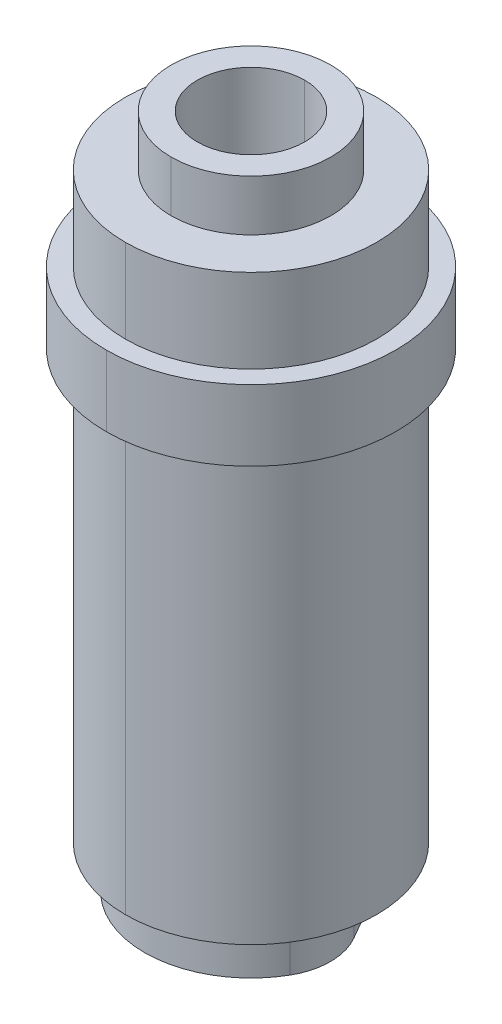
ISO-10303-21;
HEADER;
FILE_DESCRIPTION(('STEP AP214'),'2;1');
FILE_NAME('part.step','',(''),(''),'','','');
FILE_SCHEMA(('AUTOMOTIVE_DESIGN { 1 0 10303 214 1 1 1 1 }'));
ENDSEC;
DATA;
#1=APPLICATION_CONTEXT('core data for automotive mechanical design processes');
#2=APPLICATION_PROTOCOL_DEFINITION('international standard','automotive_design',2000,#1);
#3=PRODUCT_CONTEXT('',#1,'mechanical');
#4=PRODUCT('Part','Part','',(#3));
#5=PRODUCT_RELATED_PRODUCT_CATEGORY('part','',(#4));
#6=PRODUCT_DEFINITION_FORMATION('','',#4);
#7=PRODUCT_DEFINITION_CONTEXT('part definition',#1,'design');
#8=PRODUCT_DEFINITION('design','',#6,#7);
#9=PRODUCT_DEFINITION_SHAPE('','',#8);
#10=(LENGTH_UNIT() NAMED_UNIT(*) SI_UNIT(.MILLI.,.METRE.));
#11=(NAMED_UNIT(*) PLANE_ANGLE_UNIT() SI_UNIT($,.RADIAN.));
#12=(NAMED_UNIT(*) SI_UNIT($,.STERADIAN.) SOLID_ANGLE_UNIT());
#13=UNCERTAINTY_MEASURE_WITH_UNIT(LENGTH_MEASURE(1.E-05),#10,'distance_accuracy_value','');
#14=(GEOMETRIC_REPRESENTATION_CONTEXT(3) GLOBAL_UNCERTAINTY_ASSIGNED_CONTEXT((#13)) GLOBAL_UNIT_ASSIGNED_CONTEXT((#10,
#11,#12)) REPRESENTATION_CONTEXT('',''));
#15=CARTESIAN_POINT('',(0.,0.,0.));
#16=DIRECTION('',(0.,0.,1.));
#17=DIRECTION('',(1.,0.,0.));
#18=AXIS2_PLACEMENT_3D('',#15,#16,#17);
#19=CARTESIAN_POINT('',(-7.449199986,0.,0.));
#20=DIRECTION('',(0.,1.,0.));
#21=DIRECTION('',(1.,0.,0.));
#22=AXIS2_PLACEMENT_3D('',#19,#20,#21);
#23=PLANE('',#22);
#24=CARTESIAN_POINT('',(0.,0.,0.));
#25=DIRECTION('',(0.,-1.,0.));
#26=DIRECTION('',(0.,0.,-1.));
#27=AXIS2_PLACEMENT_3D('',#24,#25,#26);
#28=CIRCLE('',#27,3.2639);
#29=CARTESIAN_POINT('',(0.,0.,-3.2639));
#30=VERTEX_POINT('',#29);
#31=CARTESIAN_POINT('',(0.,0.,3.2639));
#32=VERTEX_POINT('',#31);
#33=EDGE_CURVE('E11',#30,#32,#28,.T.);
#34=ORIENTED_EDGE('',*,*,#33,.F.);
#35=CARTESIAN_POINT('',(0.,0.,0.));
#36=DIRECTION('',(0.,-1.,0.));
#37=DIRECTION('',(0.,0.,-1.));
#38=AXIS2_PLACEMENT_3D('',#35,#36,#37);
#39=CIRCLE('',#38,3.2639);
#40=EDGE_CURVE('E264',#32,#30,#39,.T.);
#41=ORIENTED_EDGE('',*,*,#40,.F.);
#42=EDGE_LOOP('',(#34,#41));
#43=FACE_BOUND('',#42,.T.);
#44=CARTESIAN_POINT('',(0.,0.,-2.54));
#45=DIRECTION('',(0.,-1.,0.));
#46=DIRECTION('',(0.,0.,-1.));
#47=AXIS2_PLACEMENT_3D('',#44,#45,#46);
#48=CIRCLE('',#47,3.81);
#49=CARTESIAN_POINT('',(-3.29955678841871,0.,-4.445));
#50=VERTEX_POINT('',#49);
#51=CARTESIAN_POINT('',(0.,0.,-6.35));
#52=VERTEX_POINT('',#51);
#53=EDGE_CURVE('E269',#50,#52,#48,.T.);
#54=ORIENTED_EDGE('',*,*,#53,.T.);
#55=CARTESIAN_POINT('',(0.,0.,-2.54));
#56=DIRECTION('',(0.,-1.,0.));
#57=DIRECTION('',(0.,0.,-1.));
#58=AXIS2_PLACEMENT_3D('',#55,#56,#57);
#59=CIRCLE('',#58,3.81);
#60=CARTESIAN_POINT('',(3.29955678841871,0.,-4.445));
#61=VERTEX_POINT('',#60);
#62=EDGE_CURVE('E275',#52,#61,#59,.T.);
#63=ORIENTED_EDGE('',*,*,#62,.T.);
#64=DIRECTION('',(0.5,0.,0.866025403784439));
#65=VECTOR('',#64,1.);
#66=CARTESIAN_POINT('',(3.29955678841871,0.,-4.445));
#67=LINE('',#66,#65);
#68=CARTESIAN_POINT('',(5.49926131403119,0.,-0.635));
#69=VERTEX_POINT('',#68);
#70=EDGE_CURVE('E42',#61,#69,#67,.T.);
#71=ORIENTED_EDGE('',*,*,#70,.T.);
#72=CARTESIAN_POINT('',(2.19970452561247,0.,1.27));
#73=DIRECTION('',(0.,-1.,0.));
#74=DIRECTION('',(0.,0.,-1.));
#75=AXIS2_PLACEMENT_3D('',#72,#73,#74);
#76=CIRCLE('',#75,3.81);
#77=CARTESIAN_POINT('',(5.49926131403119,0.,3.175));
#78=VERTEX_POINT('',#77);
#79=EDGE_CURVE('E274',#69,#78,#76,.T.);
#80=ORIENTED_EDGE('',*,*,#79,.T.);
#81=CARTESIAN_POINT('',(0.,0.,0.));
#82=DIRECTION('',(0.,-1.,0.));
#83=DIRECTION('',(0.,0.,-1.));
#84=AXIS2_PLACEMENT_3D('',#81,#82,#83);
#85=CIRCLE('',#84,6.35);
#86=CARTESIAN_POINT('',(-5.49926131403119,0.,3.175));
#87=VERTEX_POINT('',#86);
#88=EDGE_CURVE('E20',#78,#87,#85,.T.);
#89=ORIENTED_EDGE('',*,*,#88,.T.);
#90=CARTESIAN_POINT('',(-2.19970452561247,0.,1.27));
#91=DIRECTION('',(0.,-1.,0.));
#92=DIRECTION('',(0.,0.,-1.));
#93=AXIS2_PLACEMENT_3D('',#90,#91,#92);
#94=CIRCLE('',#93,3.81);
#95=CARTESIAN_POINT('',(-5.49926131403119,0.,-0.635));
#96=VERTEX_POINT('',#95);
#97=EDGE_CURVE('E191',#87,#96,#94,.T.);
#98=ORIENTED_EDGE('',*,*,#97,.T.);
#99=DIRECTION('',(0.5,0.,-0.866025403784439));
#100=VECTOR('',#99,1.);
#101=CARTESIAN_POINT('',(-5.49926131403119,0.,-0.635));
#102=LINE('',#101,#100);
#103=EDGE_CURVE('E278',#96,#50,#102,.T.);
#104=ORIENTED_EDGE('',*,*,#103,.T.);
#105=EDGE_LOOP('',(#54,#63,#71,#80,#89,#98,#104));
#106=FACE_BOUND('',#105,.T.);
#107=ADVANCED_FACE('F16',(#43,#106),#23,.F.);
#108=CARTESIAN_POINT('',(0.,19.05,0.));
#109=DIRECTION('',(0.,-1.,0.));
#110=DIRECTION('',(0.,0.,-1.));
#111=AXIS2_PLACEMENT_3D('',#108,#109,#110);
#112=CYLINDRICAL_SURFACE('',#111,3.2639);
#113=DIRECTION('',(0.,-1.,0.));
#114=VECTOR('',#113,1.);
#115=CARTESIAN_POINT('',(0.,19.05,3.2639));
#116=LINE('',#115,#114);
#117=CARTESIAN_POINT('',(0.,6.35,3.2639));
#118=VERTEX_POINT('',#117);
#119=EDGE_CURVE('E341',#118,#32,#116,.T.);
#120=ORIENTED_EDGE('',*,*,#119,.F.);
#121=CARTESIAN_POINT('',(0.,6.35,0.));
#122=DIRECTION('',(0.,-1.,0.));
#123=DIRECTION('',(0.,0.,-1.));
#124=AXIS2_PLACEMENT_3D('',#121,#122,#123);
#125=CIRCLE('',#124,3.2639);
#126=CARTESIAN_POINT('',(0.,6.35,-3.2639));
#127=VERTEX_POINT('',#126);
#128=EDGE_CURVE('E27',#127,#118,#125,.T.);
#129=ORIENTED_EDGE('',*,*,#128,.F.);
#130=DIRECTION('',(0.,-1.,0.));
#131=VECTOR('',#130,1.);
#132=CARTESIAN_POINT('',(0.,19.05,-3.2639));
#133=LINE('',#132,#131);
#134=EDGE_CURVE('E306',#127,#30,#133,.T.);
#135=ORIENTED_EDGE('',*,*,#134,.T.);
#136=ORIENTED_EDGE('',*,*,#33,.T.);
#137=EDGE_LOOP('',(#120,#129,#135,#136));
#138=FACE_BOUND('',#137,.T.);
#139=ADVANCED_FACE('F730',(#138),#112,.F.);
#140=CARTESIAN_POINT('',(-2.5527,6.35,0.));
#141=DIRECTION('',(0.,1.,0.));
#142=DIRECTION('',(1.,0.,0.));
#143=AXIS2_PLACEMENT_3D('',#140,#141,#142);
#144=PLANE('',#143);
#145=CARTESIAN_POINT('',(0.,6.35,0.));
#146=DIRECTION('',(0.,-1.,0.));
#147=DIRECTION('',(0.,0.,-1.));
#148=AXIS2_PLACEMENT_3D('',#145,#146,#147);
#149=CIRCLE('',#148,2.5527);
#150=CARTESIAN_POINT('',(0.,6.35,-2.5527));
#151=VERTEX_POINT('',#150);
#152=CARTESIAN_POINT('',(0.,6.35,2.5527));
#153=VERTEX_POINT('',#152);
#154=EDGE_CURVE('E303',#151,#153,#149,.T.);
#155=ORIENTED_EDGE('',*,*,#154,.F.);
#156=CARTESIAN_POINT('',(0.,6.35,0.));
#157=DIRECTION('',(0.,-1.,0.));
#158=DIRECTION('',(0.,0.,-1.));
#159=AXIS2_PLACEMENT_3D('',#156,#157,#158);
#160=CIRCLE('',#159,2.5527);
#161=EDGE_CURVE('E294',#153,#151,#160,.T.);
#162=ORIENTED_EDGE('',*,*,#161,.F.);
#163=EDGE_LOOP('',(#155,#162));
#164=FACE_BOUND('',#163,.T.);
#165=ORIENTED_EDGE('',*,*,#128,.T.);
#166=CARTESIAN_POINT('',(0.,6.35,0.));
#167=DIRECTION('',(0.,-1.,0.));
#168=DIRECTION('',(0.,0.,-1.));
#169=AXIS2_PLACEMENT_3D('',#166,#167,#168);
#170=CIRCLE('',#169,3.2639);
#171=EDGE_CURVE('E337',#118,#127,#170,.T.);
#172=ORIENTED_EDGE('',*,*,#171,.T.);
#173=EDGE_LOOP('',(#165,#172));
#174=FACE_BOUND('',#173,.T.);
#175=ADVANCED_FACE('F505',(#164,#174),#144,.F.);
#176=CARTESIAN_POINT('',(0.,19.05,0.));
#177=DIRECTION('',(0.,-1.,0.));
#178=DIRECTION('',(0.,0.,-1.));
#179=AXIS2_PLACEMENT_3D('',#176,#177,#178);
#180=CYLINDRICAL_SURFACE('',#179,2.5527);
#181=DIRECTION('',(0.,-1.,0.));
#182=VECTOR('',#181,1.);
#183=CARTESIAN_POINT('',(0.,19.05,2.5527));
#184=LINE('',#183,#182);
#185=CARTESIAN_POINT('',(0.,27.621700408,2.5527));
#186=VERTEX_POINT('',#185);
#187=EDGE_CURVE('E346',#186,#153,#184,.T.);
#188=ORIENTED_EDGE('',*,*,#187,.F.);
#189=CARTESIAN_POINT('',(0.,27.621700408,0.));
#190=DIRECTION('',(0.,-1.,0.));
#191=DIRECTION('',(0.,0.,-1.));
#192=AXIS2_PLACEMENT_3D('',#189,#190,#191);
#193=CIRCLE('',#192,2.5527);
#194=CARTESIAN_POINT('',(0.,27.621700408,-2.5527));
#195=VERTEX_POINT('',#194);
#196=EDGE_CURVE('E289',#195,#186,#193,.T.);
#197=ORIENTED_EDGE('',*,*,#196,.F.);
#198=DIRECTION('',(0.,-1.,0.));
#199=VECTOR('',#198,1.);
#200=CARTESIAN_POINT('',(0.,19.05,-2.5527));
#201=LINE('',#200,#199);
#202=EDGE_CURVE('E290',#195,#151,#201,.T.);
#203=ORIENTED_EDGE('',*,*,#202,.T.);
#204=ORIENTED_EDGE('',*,*,#154,.T.);
#205=EDGE_LOOP('',(#188,#197,#203,#204));
#206=FACE_BOUND('',#205,.T.);
#207=ADVANCED_FACE('F503',(#206),#180,.F.);
#208=CARTESIAN_POINT('',(3.29955678841871,23.6095192980614,-4.445));
#209=DIRECTION('',(0.866025403784439,0.,-0.5));
#210=DIRECTION('',(0.,-1.,0.));
#211=AXIS2_PLACEMENT_3D('',#208,#209,#210);
#212=PLANE('',#211);
#213=DIRECTION('',(0.5,0.,0.866025403784439));
#214=VECTOR('',#213,1.);
#215=CARTESIAN_POINT('',(3.29955678841871,2.54,-4.445));
#216=LINE('',#215,#214);
#217=CARTESIAN_POINT('',(3.29955678841871,2.54,-4.445));
#218=VERTEX_POINT('',#217);
#219=CARTESIAN_POINT('',(5.49926131403119,2.54,-0.635));
#220=VERTEX_POINT('',#219);
#221=EDGE_CURVE('E299',#218,#220,#216,.T.);
#222=ORIENTED_EDGE('',*,*,#221,.T.);
#223=DIRECTION('',(0.,-1.,0.));
#224=VECTOR('',#223,1.);
#225=CARTESIAN_POINT('',(5.49926131403119,23.6095192980614,-0.635));
#226=LINE('',#225,#224);
#227=EDGE_CURVE('E271',#220,#69,#226,.T.);
#228=ORIENTED_EDGE('',*,*,#227,.T.);
#229=ORIENTED_EDGE('',*,*,#70,.F.);
#230=DIRECTION('',(0.,-1.,0.));
#231=VECTOR('',#230,1.);
#232=CARTESIAN_POINT('',(3.29955678841871,23.6095192980614,-4.445));
#233=LINE('',#232,#231);
#234=EDGE_CURVE('E279',#218,#61,#233,.T.);
#235=ORIENTED_EDGE('',*,*,#234,.F.);
#236=EDGE_LOOP('',(#222,#228,#229,#235));
#237=FACE_BOUND('',#236,.T.);
#238=ADVANCED_FACE('F423',(#237),#212,.T.);
#239=CARTESIAN_POINT('',(2.19970452561247,23.6095192980614,1.27));
#240=DIRECTION('',(0.,-1.,0.));
#241=DIRECTION('',(0.,0.,-1.));
#242=AXIS2_PLACEMENT_3D('',#239,#240,#241);
#243=CYLINDRICAL_SURFACE('',#242,3.81);
#244=CARTESIAN_POINT('',(2.19970452561247,2.54,1.27));
#245=DIRECTION('',(0.,-1.,0.));
#246=DIRECTION('',(0.,0.,1.));
#247=AXIS2_PLACEMENT_3D('',#244,#245,#246);
#248=CIRCLE('',#247,3.81);
#249=CARTESIAN_POINT('',(5.49926131403119,2.54,3.175));
#250=VERTEX_POINT('',#249);
#251=EDGE_CURVE('E295',#220,#250,#248,.T.);
#252=ORIENTED_EDGE('',*,*,#251,.T.);
#253=DIRECTION('',(0.,-1.,0.));
#254=VECTOR('',#253,1.);
#255=CARTESIAN_POINT('',(5.49926131403119,23.6095192980614,3.175));
#256=LINE('',#255,#254);
#257=EDGE_CURVE('E314',#250,#78,#256,.T.);
#258=ORIENTED_EDGE('',*,*,#257,.T.);
#259=ORIENTED_EDGE('',*,*,#79,.F.);
#260=ORIENTED_EDGE('',*,*,#227,.F.);
#261=EDGE_LOOP('',(#252,#258,#259,#260));
#262=FACE_BOUND('',#261,.T.);
#263=ADVANCED_FACE('F426',(#262),#243,.T.);
#264=CARTESIAN_POINT('',(0.,23.6095192980614,0.));
#265=DIRECTION('',(0.,-1.,0.));
#266=DIRECTION('',(0.,0.,-1.));
#267=AXIS2_PLACEMENT_3D('',#264,#265,#266);
#268=CYLINDRICAL_SURFACE('',#267,6.35);
#269=CARTESIAN_POINT('',(0.,2.54,0.));
#270=DIRECTION('',(0.,-1.,0.));
#271=DIRECTION('',(0.,0.,1.));
#272=AXIS2_PLACEMENT_3D('',#269,#270,#271);
#273=CIRCLE('',#272,6.35);
#274=CARTESIAN_POINT('',(-5.49926131403119,2.54,3.175));
#275=VERTEX_POINT('',#274);
#276=EDGE_CURVE('E300',#250,#275,#273,.T.);
#277=ORIENTED_EDGE('',*,*,#276,.T.);
#278=DIRECTION('',(0.,-1.,0.));
#279=VECTOR('',#278,1.);
#280=CARTESIAN_POINT('',(-5.49926131403119,23.6095192980614,3.175));
#281=LINE('',#280,#279);
#282=EDGE_CURVE('E320',#275,#87,#281,.T.);
#283=ORIENTED_EDGE('',*,*,#282,.T.);
#284=ORIENTED_EDGE('',*,*,#88,.F.);
#285=ORIENTED_EDGE('',*,*,#257,.F.);
#286=EDGE_LOOP('',(#277,#283,#284,#285));
#287=FACE_BOUND('',#286,.T.);
#288=ADVANCED_FACE('F774',(#287),#268,.T.);
#289=CARTESIAN_POINT('',(-2.19970452561247,23.6095192980614,1.27));
#290=DIRECTION('',(0.,-1.,0.));
#291=DIRECTION('',(0.,0.,-1.));
#292=AXIS2_PLACEMENT_3D('',#289,#290,#291);
#293=CYLINDRICAL_SURFACE('',#292,3.81);
#294=CARTESIAN_POINT('',(-2.19970452561247,2.54,1.27));
#295=DIRECTION('',(0.,-1.,0.));
#296=DIRECTION('',(0.,0.,1.));
#297=AXIS2_PLACEMENT_3D('',#294,#295,#296);
#298=CIRCLE('',#297,3.81);
#299=CARTESIAN_POINT('',(-5.49926131403119,2.54,-0.635));
#300=VERTEX_POINT('',#299);
#301=EDGE_CURVE('E356',#275,#300,#298,.T.);
#302=ORIENTED_EDGE('',*,*,#301,.T.);
#303=DIRECTION('',(0.,-1.,0.));
#304=VECTOR('',#303,1.);
#305=CARTESIAN_POINT('',(-5.49926131403119,23.6095192980614,-0.635));
#306=LINE('',#305,#304);
#307=EDGE_CURVE('E141',#300,#96,#306,.T.);
#308=ORIENTED_EDGE('',*,*,#307,.T.);
#309=ORIENTED_EDGE('',*,*,#97,.F.);
#310=ORIENTED_EDGE('',*,*,#282,.F.);
#311=EDGE_LOOP('',(#302,#308,#309,#310));
#312=FACE_BOUND('',#311,.T.);
#313=ADVANCED_FACE('F768',(#312),#293,.T.);
#314=CARTESIAN_POINT('',(-5.49926131403119,23.6095192980614,-0.635));
#315=DIRECTION('',(-0.866025403784439,0.,-0.5));
#316=DIRECTION('',(-0.5,0.,0.866025403784439));
#317=AXIS2_PLACEMENT_3D('',#314,#315,#316);
#318=PLANE('',#317);
#319=DIRECTION('',(0.5,0.,-0.866025403784439));
#320=VECTOR('',#319,1.);
#321=CARTESIAN_POINT('',(-5.49926131403119,2.54,-0.635));
#322=LINE('',#321,#320);
#323=CARTESIAN_POINT('',(-3.29955678841871,2.54,-4.445));
#324=VERTEX_POINT('',#323);
#325=EDGE_CURVE('E288',#300,#324,#322,.T.);
#326=ORIENTED_EDGE('',*,*,#325,.T.);
#327=DIRECTION('',(0.,-1.,0.));
#328=VECTOR('',#327,1.);
#329=CARTESIAN_POINT('',(-3.29955678841871,23.6095192980614,-4.445));
#330=LINE('',#329,#328);
#331=EDGE_CURVE('E332',#324,#50,#330,.T.);
#332=ORIENTED_EDGE('',*,*,#331,.T.);
#333=ORIENTED_EDGE('',*,*,#103,.F.);
#334=ORIENTED_EDGE('',*,*,#307,.F.);
#335=EDGE_LOOP('',(#326,#332,#333,#334));
#336=FACE_BOUND('',#335,.T.);
#337=ADVANCED_FACE('F773',(#336),#318,.T.);
#338=CARTESIAN_POINT('',(0.,23.6095192980614,-2.54));
#339=DIRECTION('',(0.,-1.,0.));
#340=DIRECTION('',(0.,0.,-1.));
#341=AXIS2_PLACEMENT_3D('',#338,#339,#340);
#342=CYLINDRICAL_SURFACE('',#341,3.81);
#343=DIRECTION('',(0.,-1.,0.));
#344=VECTOR('',#343,1.);
#345=CARTESIAN_POINT('',(0.,23.6095192980614,-6.35));
#346=LINE('',#345,#344);
#347=CARTESIAN_POINT('',(0.,2.54,-6.35));
#348=VERTEX_POINT('',#347);
#349=EDGE_CURVE('E265',#348,#52,#346,.T.);
#350=ORIENTED_EDGE('',*,*,#349,.F.);
#351=CARTESIAN_POINT('',(0.,2.54,-2.54));
#352=DIRECTION('',(0.,-1.,0.));
#353=DIRECTION('',(0.,0.,1.));
#354=AXIS2_PLACEMENT_3D('',#351,#352,#353);
#355=CIRCLE('',#354,3.81);
#356=EDGE_CURVE('E238',#348,#218,#355,.T.);
#357=ORIENTED_EDGE('',*,*,#356,.T.);
#358=ORIENTED_EDGE('',*,*,#234,.T.);
#359=ORIENTED_EDGE('',*,*,#62,.F.);
#360=EDGE_LOOP('',(#350,#357,#358,#359));
#361=FACE_BOUND('',#360,.T.);
#362=ADVANCED_FACE('F415',(#361),#342,.T.);
#363=CARTESIAN_POINT('',(-4.7625,37.285900282,0.));
#364=DIRECTION('',(0.,-1.,0.));
#365=DIRECTION('',(0.,0.,-1.));
#366=AXIS2_PLACEMENT_3D('',#363,#364,#365);
#367=PLANE('',#366);
#368=CARTESIAN_POINT('',(0.,37.285900282,0.));
#369=DIRECTION('',(0.,-1.,0.));
#370=DIRECTION('',(0.,0.,-1.));
#371=AXIS2_PLACEMENT_3D('',#368,#369,#370);
#372=CIRCLE('',#371,4.7625);
#373=CARTESIAN_POINT('',(0.,37.285900282,-4.7625));
#374=VERTEX_POINT('',#373);
#375=CARTESIAN_POINT('',(0.,37.285900282,4.7625));
#376=VERTEX_POINT('',#375);
#377=EDGE_CURVE('E327',#374,#376,#372,.T.);
#378=ORIENTED_EDGE('',*,*,#377,.T.);
#379=CARTESIAN_POINT('',(0.,37.285900282,0.));
#380=DIRECTION('',(0.,-1.,0.));
#381=DIRECTION('',(0.,0.,-1.));
#382=AXIS2_PLACEMENT_3D('',#379,#380,#381);
#383=CIRCLE('',#382,4.7625);
#384=EDGE_CURVE('E154',#376,#374,#383,.T.);
#385=ORIENTED_EDGE('',*,*,#384,.T.);
#386=EDGE_LOOP('',(#378,#385));
#387=FACE_BOUND('',#386,.T.);
#388=CARTESIAN_POINT('',(0.,37.285900282,0.));
#389=DIRECTION('',(0.,-1.,0.));
#390=DIRECTION('',(0.,0.,-1.));
#391=AXIS2_PLACEMENT_3D('',#388,#389,#390);
#392=CIRCLE('',#391,7.499999986);
#393=CARTESIAN_POINT('',(0.,37.285900282,-7.499999986));
#394=VERTEX_POINT('',#393);
#395=CARTESIAN_POINT('',(0.,37.285900282,7.499999986));
#396=VERTEX_POINT('',#395);
#397=EDGE_CURVE('E336',#394,#396,#392,.T.);
#398=ORIENTED_EDGE('',*,*,#397,.F.);
#399=CARTESIAN_POINT('',(0.,37.285900282,0.));
#400=DIRECTION('',(0.,-1.,0.));
#401=DIRECTION('',(0.,0.,-1.));
#402=AXIS2_PLACEMENT_3D('',#399,#400,#401);
#403=CIRCLE('',#402,7.499999986);
#404=EDGE_CURVE('E282',#396,#394,#403,.T.);
#405=ORIENTED_EDGE('',*,*,#404,.F.);
#406=EDGE_LOOP('',(#398,#405));
#407=FACE_BOUND('',#406,.T.);
#408=ADVANCED_FACE('F693',(#387,#407),#367,.F.);
#409=CARTESIAN_POINT('',(0.,19.05,0.));
#410=DIRECTION('',(0.,-1.,0.));
#411=DIRECTION('',(0.,0.,-1.));
#412=AXIS2_PLACEMENT_3D('',#409,#410,#411);
#413=CYLINDRICAL_SURFACE('',#412,7.499999986);
#414=DIRECTION('',(0.,-1.,0.));
#415=VECTOR('',#414,1.);
#416=CARTESIAN_POINT('',(0.,19.05,7.499999986));
#417=LINE('',#416,#415);
#418=CARTESIAN_POINT('',(0.,32.285900376,7.499999986));
#419=VERTEX_POINT('',#418);
#420=EDGE_CURVE('E345',#396,#419,#417,.T.);
#421=ORIENTED_EDGE('',*,*,#420,.F.);
#422=ORIENTED_EDGE('',*,*,#404,.T.);
#423=DIRECTION('',(0.,-1.,0.));
#424=VECTOR('',#423,1.);
#425=CARTESIAN_POINT('',(0.,19.05,-7.499999986));
#426=LINE('',#425,#424);
#427=CARTESIAN_POINT('',(0.,32.285900376,-7.499999986));
#428=VERTEX_POINT('',#427);
#429=EDGE_CURVE('E385',#394,#428,#426,.T.);
#430=ORIENTED_EDGE('',*,*,#429,.T.);
#431=CARTESIAN_POINT('',(0.,32.285900376,0.));
#432=DIRECTION('',(0.,-1.,0.));
#433=DIRECTION('',(0.,0.,-1.));
#434=AXIS2_PLACEMENT_3D('',#431,#432,#433);
#435=CIRCLE('',#434,7.499999986);
#436=EDGE_CURVE('E280',#419,#428,#435,.T.);
#437=ORIENTED_EDGE('',*,*,#436,.F.);
#438=EDGE_LOOP('',(#421,#422,#430,#437));
#439=FACE_BOUND('',#438,.T.);
#440=ADVANCED_FACE('F471',(#439),#413,.T.);
#441=CARTESIAN_POINT('',(-8.636,32.285900376,0.));
#442=DIRECTION('',(0.,-1.,0.));
#443=DIRECTION('',(0.,0.,-1.));
#444=AXIS2_PLACEMENT_3D('',#441,#442,#443);
#445=PLANE('',#444);
#446=CARTESIAN_POINT('',(0.,32.285900376,0.));
#447=DIRECTION('',(0.,-1.,0.));
#448=DIRECTION('',(0.,0.,-1.));
#449=AXIS2_PLACEMENT_3D('',#446,#447,#448);
#450=CIRCLE('',#449,7.499999986);
#451=EDGE_CURVE('E381',#428,#419,#450,.T.);
#452=ORIENTED_EDGE('',*,*,#451,.T.);
#453=ORIENTED_EDGE('',*,*,#436,.T.);
#454=EDGE_LOOP('',(#452,#453));
#455=FACE_BOUND('',#454,.T.);
#456=CARTESIAN_POINT('',(0.,32.285900376,0.));
#457=DIRECTION('',(0.,-1.,0.));
#458=DIRECTION('',(0.,0.,-1.));
#459=AXIS2_PLACEMENT_3D('',#456,#457,#458);
#460=CIRCLE('',#459,8.636);
#461=CARTESIAN_POINT('',(0.,32.285900376,-8.636));
#462=VERTEX_POINT('',#461);
#463=CARTESIAN_POINT('',(0.,32.285900376,8.636));
#464=VERTEX_POINT('',#463);
#465=EDGE_CURVE('E389',#462,#464,#460,.T.);
#466=ORIENTED_EDGE('',*,*,#465,.F.);
#467=CARTESIAN_POINT('',(0.,32.285900376,0.));
#468=DIRECTION('',(0.,-1.,0.));
#469=DIRECTION('',(0.,0.,-1.));
#470=AXIS2_PLACEMENT_3D('',#467,#468,#469);
#471=CIRCLE('',#470,8.636);
#472=EDGE_CURVE('E283',#464,#462,#471,.T.);
#473=ORIENTED_EDGE('',*,*,#472,.F.);
#474=EDGE_LOOP('',(#466,#473));
#475=FACE_BOUND('',#474,.T.);
#476=ADVANCED_FACE('F18',(#455,#475),#445,.F.);
#477=CARTESIAN_POINT('',(0.,19.05,0.));
#478=DIRECTION('',(0.,-1.,0.));
#479=DIRECTION('',(0.,0.,-1.));
#480=AXIS2_PLACEMENT_3D('',#477,#478,#479);
#481=CYLINDRICAL_SURFACE('',#480,8.636);
#482=DIRECTION('',(0.,-1.,0.));
#483=VECTOR('',#482,1.);
#484=CARTESIAN_POINT('',(0.,19.05,8.636));
#485=LINE('',#484,#483);
#486=CARTESIAN_POINT('',(0.,28.067,8.636));
#487=VERTEX_POINT('',#486);
#488=EDGE_CURVE('E393',#464,#487,#485,.T.);
#489=ORIENTED_EDGE('',*,*,#488,.F.);
#490=ORIENTED_EDGE('',*,*,#472,.T.);
#491=DIRECTION('',(0.,-1.,0.));
#492=VECTOR('',#491,1.);
#493=CARTESIAN_POINT('',(0.,19.05,-8.636));
#494=LINE('',#493,#492);
#495=CARTESIAN_POINT('',(0.,28.067,-8.636));
#496=VERTEX_POINT('',#495);
#497=EDGE_CURVE('E251',#462,#496,#494,.T.);
#498=ORIENTED_EDGE('',*,*,#497,.T.);
#499=CARTESIAN_POINT('',(0.,28.067,0.));
#500=DIRECTION('',(0.,-1.,0.));
#501=DIRECTION('',(0.,0.,-1.));
#502=AXIS2_PLACEMENT_3D('',#499,#500,#501);
#503=CIRCLE('',#502,8.636);
#504=EDGE_CURVE('E237',#487,#496,#503,.T.);
#505=ORIENTED_EDGE('',*,*,#504,.F.);
#506=EDGE_LOOP('',(#489,#490,#498,#505));
#507=FACE_BOUND('',#506,.T.);
#508=ADVANCED_FACE('F475',(#507),#481,.T.);
#509=CARTESIAN_POINT('',(-8.636,28.067,0.));
#510=DIRECTION('',(0.,1.,0.));
#511=DIRECTION('',(1.,0.,0.));
#512=AXIS2_PLACEMENT_3D('',#509,#510,#511);
#513=PLANE('',#512);
#514=CARTESIAN_POINT('',(0.,28.067,0.));
#515=DIRECTION('',(0.,-1.,0.));
#516=DIRECTION('',(0.,0.,-1.));
#517=AXIS2_PLACEMENT_3D('',#514,#515,#516);
#518=CIRCLE('',#517,7.499999986);
#519=CARTESIAN_POINT('',(0.,28.067,-7.499999986));
#520=VERTEX_POINT('',#519);
#521=CARTESIAN_POINT('',(0.,28.067,7.499999986));
#522=VERTEX_POINT('',#521);
#523=EDGE_CURVE('E242',#520,#522,#518,.T.);
#524=ORIENTED_EDGE('',*,*,#523,.F.);
#525=CARTESIAN_POINT('',(0.,28.067,0.));
#526=DIRECTION('',(0.,-1.,0.));
#527=DIRECTION('',(0.,0.,-1.));
#528=AXIS2_PLACEMENT_3D('',#525,#526,#527);
#529=CIRCLE('',#528,7.499999986);
#530=EDGE_CURVE('E222',#522,#520,#529,.T.);
#531=ORIENTED_EDGE('',*,*,#530,.F.);
#532=EDGE_LOOP('',(#524,#531));
#533=FACE_BOUND('',#532,.T.);
#534=CARTESIAN_POINT('',(0.,28.067,0.));
#535=DIRECTION('',(0.,-1.,0.));
#536=DIRECTION('',(0.,0.,-1.));
#537=AXIS2_PLACEMENT_3D('',#534,#535,#536);
#538=CIRCLE('',#537,8.636);
#539=EDGE_CURVE('E260',#496,#487,#538,.T.);
#540=ORIENTED_EDGE('',*,*,#539,.T.);
#541=ORIENTED_EDGE('',*,*,#504,.T.);
#542=EDGE_LOOP('',(#540,#541));
#543=FACE_BOUND('',#542,.T.);
#544=ADVANCED_FACE('F248',(#533,#543),#513,.F.);
#545=CARTESIAN_POINT('',(0.,19.05,0.));
#546=DIRECTION('',(0.,-1.,0.));
#547=DIRECTION('',(0.,0.,-1.));
#548=AXIS2_PLACEMENT_3D('',#545,#546,#547);
#549=CYLINDRICAL_SURFACE('',#548,7.499999986);
#550=DIRECTION('',(0.,-1.,0.));
#551=VECTOR('',#550,1.);
#552=CARTESIAN_POINT('',(0.,19.05,7.499999986));
#553=LINE('',#552,#551);
#554=CARTESIAN_POINT('',(0.,2.54,7.499999986));
#555=VERTEX_POINT('',#554);
#556=EDGE_CURVE('E234',#522,#555,#553,.T.);
#557=ORIENTED_EDGE('',*,*,#556,.F.);
#558=ORIENTED_EDGE('',*,*,#530,.T.);
#559=DIRECTION('',(0.,-1.,0.));
#560=VECTOR('',#559,1.);
#561=CARTESIAN_POINT('',(0.,19.05,-7.499999986));
#562=LINE('',#561,#560);
#563=CARTESIAN_POINT('',(0.,2.54,-7.499999986));
#564=VERTEX_POINT('',#563);
#565=EDGE_CURVE('E231',#520,#564,#562,.T.);
#566=ORIENTED_EDGE('',*,*,#565,.T.);
#567=CARTESIAN_POINT('',(0.,2.54,0.));
#568=DIRECTION('',(0.,-1.,0.));
#569=DIRECTION('',(0.,0.,-1.));
#570=AXIS2_PLACEMENT_3D('',#567,#568,#569);
#571=CIRCLE('',#570,7.499999986);
#572=EDGE_CURVE('E285',#555,#564,#571,.T.);
#573=ORIENTED_EDGE('',*,*,#572,.F.);
#574=EDGE_LOOP('',(#557,#558,#566,#573));
#575=FACE_BOUND('',#574,.T.);
#576=ADVANCED_FACE('F230',(#575),#549,.T.);
#577=CARTESIAN_POINT('',(-7.499999986,2.54,0.));
#578=DIRECTION('',(0.,1.,0.));
#579=DIRECTION('',(1.,0.,0.));
#580=AXIS2_PLACEMENT_3D('',#577,#578,#579);
#581=PLANE('',#580);
#582=ORIENTED_EDGE('',*,*,#325,.F.);
#583=ORIENTED_EDGE('',*,*,#301,.F.);
#584=ORIENTED_EDGE('',*,*,#276,.F.);
#585=ORIENTED_EDGE('',*,*,#251,.F.);
#586=ORIENTED_EDGE('',*,*,#221,.F.);
#587=ORIENTED_EDGE('',*,*,#356,.F.);
#588=CARTESIAN_POINT('',(0.,2.54,-2.54));
#589=DIRECTION('',(0.,-1.,0.));
#590=DIRECTION('',(0.,0.,1.));
#591=AXIS2_PLACEMENT_3D('',#588,#589,#590);
#592=CIRCLE('',#591,3.81);
#593=EDGE_CURVE('E270',#324,#348,#592,.T.);
#594=ORIENTED_EDGE('',*,*,#593,.F.);
#595=EDGE_LOOP('',(#582,#583,#584,#585,#586,#587,#594));
#596=FACE_BOUND('',#595,.T.);
#597=CARTESIAN_POINT('',(0.,2.54,0.));
#598=DIRECTION('',(0.,-1.,0.));
#599=DIRECTION('',(0.,0.,-1.));
#600=AXIS2_PLACEMENT_3D('',#597,#598,#599);
#601=CIRCLE('',#600,7.499999986);
#602=EDGE_CURVE('E244',#564,#555,#601,.T.);
#603=ORIENTED_EDGE('',*,*,#602,.T.);
#604=ORIENTED_EDGE('',*,*,#572,.T.);
#605=EDGE_LOOP('',(#603,#604));
#606=FACE_BOUND('',#605,.T.);
#607=ADVANCED_FACE('F420',(#596,#606),#581,.F.);
#608=CARTESIAN_POINT('',(-3.2004,27.621700408,0.));
#609=DIRECTION('',(0.,-1.,0.));
#610=DIRECTION('',(0.,0.,-1.));
#611=AXIS2_PLACEMENT_3D('',#608,#609,#610);
#612=PLANE('',#611);
#613=ORIENTED_EDGE('',*,*,#196,.T.);
#614=CARTESIAN_POINT('',(0.,27.621700408,0.));
#615=DIRECTION('',(0.,-1.,0.));
#616=DIRECTION('',(0.,0.,-1.));
#617=AXIS2_PLACEMENT_3D('',#614,#615,#616);
#618=CIRCLE('',#617,2.5527);
#619=EDGE_CURVE('E310',#186,#195,#618,.T.);
#620=ORIENTED_EDGE('',*,*,#619,.T.);
#621=EDGE_LOOP('',(#613,#620));
#622=FACE_BOUND('',#621,.T.);
#623=CARTESIAN_POINT('',(0.,27.621700408,0.));
#624=DIRECTION('',(0.,-1.,0.));
#625=DIRECTION('',(0.,0.,-1.));
#626=AXIS2_PLACEMENT_3D('',#623,#624,#625);
#627=CIRCLE('',#626,3.2004);
#628=CARTESIAN_POINT('',(0.,27.621700408,-3.2004));
#629=VERTEX_POINT('',#628);
#630=CARTESIAN_POINT('',(0.,27.621700408,3.2004));
#631=VERTEX_POINT('',#630);
#632=EDGE_CURVE('E367',#629,#631,#627,.T.);
#633=ORIENTED_EDGE('',*,*,#632,.F.);
#634=CARTESIAN_POINT('',(0.,27.621700408,0.));
#635=DIRECTION('',(0.,-1.,0.));
#636=DIRECTION('',(0.,0.,-1.));
#637=AXIS2_PLACEMENT_3D('',#634,#635,#636);
#638=CIRCLE('',#637,3.2004);
#639=EDGE_CURVE('E321',#631,#629,#638,.T.);
#640=ORIENTED_EDGE('',*,*,#639,.F.);
#641=EDGE_LOOP('',(#633,#640));
#642=FACE_BOUND('',#641,.T.);
#643=ADVANCED_FACE('F494',(#622,#642),#612,.F.);
#644=CARTESIAN_POINT('',(0.,19.05,0.));
#645=DIRECTION('',(0.,-1.,0.));
#646=DIRECTION('',(0.,0.,-1.));
#647=AXIS2_PLACEMENT_3D('',#644,#645,#646);
#648=CYLINDRICAL_SURFACE('',#647,3.2004);
#649=DIRECTION('',(0.,-1.,0.));
#650=VECTOR('',#649,1.);
#651=CARTESIAN_POINT('',(0.,19.05,3.2004));
#652=LINE('',#651,#650);
#653=CARTESIAN_POINT('',(0.,40.321700408,3.2004));
#654=VERTEX_POINT('',#653);
#655=EDGE_CURVE('E326',#654,#631,#652,.T.);
#656=ORIENTED_EDGE('',*,*,#655,.F.);
#657=CARTESIAN_POINT('',(0.,40.321700408,0.));
#658=DIRECTION('',(0.,-1.,0.));
#659=DIRECTION('',(0.,0.,-1.));
#660=AXIS2_PLACEMENT_3D('',#657,#658,#659);
#661=CIRCLE('',#660,3.2004);
#662=CARTESIAN_POINT('',(0.,40.321700408,-3.2004));
#663=VERTEX_POINT('',#662);
#664=EDGE_CURVE('E364',#663,#654,#661,.T.);
#665=ORIENTED_EDGE('',*,*,#664,.F.);
#666=DIRECTION('',(0.,-1.,0.));
#667=VECTOR('',#666,1.);
#668=CARTESIAN_POINT('',(0.,19.05,-3.2004));
#669=LINE('',#668,#667);
#670=EDGE_CURVE('E325',#663,#629,#669,.T.);
#671=ORIENTED_EDGE('',*,*,#670,.T.);
#672=ORIENTED_EDGE('',*,*,#632,.T.);
#673=EDGE_LOOP('',(#656,#665,#671,#672));
#674=FACE_BOUND('',#673,.T.);
#675=ADVANCED_FACE('F756',(#674),#648,.F.);
#676=CARTESIAN_POINT('',(-4.7625,40.321700408,0.));
#677=DIRECTION('',(0.,-1.,0.));
#678=DIRECTION('',(0.,0.,-1.));
#679=AXIS2_PLACEMENT_3D('',#676,#677,#678);
#680=PLANE('',#679);
#681=ORIENTED_EDGE('',*,*,#664,.T.);
#682=CARTESIAN_POINT('',(0.,40.321700408,0.));
#683=DIRECTION('',(0.,-1.,0.));
#684=DIRECTION('',(0.,0.,-1.));
#685=AXIS2_PLACEMENT_3D('',#682,#683,#684);
#686=CIRCLE('',#685,3.2004);
#687=EDGE_CURVE('E246',#654,#663,#686,.T.);
#688=ORIENTED_EDGE('',*,*,#687,.T.);
#689=EDGE_LOOP('',(#681,#688));
#690=FACE_BOUND('',#689,.T.);
#691=CARTESIAN_POINT('',(0.,40.321700408,0.));
#692=DIRECTION('',(0.,-1.,0.));
#693=DIRECTION('',(0.,0.,-1.));
#694=AXIS2_PLACEMENT_3D('',#691,#692,#693);
#695=CIRCLE('',#694,4.7625);
#696=CARTESIAN_POINT('',(0.,40.321700408,-4.7625));
#697=VERTEX_POINT('',#696);
#698=CARTESIAN_POINT('',(0.,40.321700408,4.7625));
#699=VERTEX_POINT('',#698);
#700=EDGE_CURVE('E360',#697,#699,#695,.T.);
#701=ORIENTED_EDGE('',*,*,#700,.F.);
#702=CARTESIAN_POINT('',(0.,40.321700408,0.));
#703=DIRECTION('',(0.,-1.,0.));
#704=DIRECTION('',(0.,0.,-1.));
#705=AXIS2_PLACEMENT_3D('',#702,#703,#704);
#706=CIRCLE('',#705,4.7625);
#707=EDGE_CURVE('E376',#699,#697,#706,.T.);
#708=ORIENTED_EDGE('',*,*,#707,.F.);
#709=EDGE_LOOP('',(#701,#708));
#710=FACE_BOUND('',#709,.T.);
#711=ADVANCED_FACE('F662',(#690,#710),#680,.F.);
#712=CARTESIAN_POINT('',(0.,19.05,0.));
#713=DIRECTION('',(0.,-1.,0.));
#714=DIRECTION('',(0.,0.,-1.));
#715=AXIS2_PLACEMENT_3D('',#712,#713,#714);
#716=CYLINDRICAL_SURFACE('',#715,4.7625);
#717=DIRECTION('',(0.,-1.,0.));
#718=VECTOR('',#717,1.);
#719=CARTESIAN_POINT('',(0.,19.05,4.7625));
#720=LINE('',#719,#718);
#721=EDGE_CURVE('E331',#699,#376,#720,.T.);
#722=ORIENTED_EDGE('',*,*,#721,.F.);
#723=ORIENTED_EDGE('',*,*,#707,.T.);
#724=DIRECTION('',(0.,-1.,0.));
#725=VECTOR('',#724,1.);
#726=CARTESIAN_POINT('',(0.,19.05,-4.7625));
#727=LINE('',#726,#725);
#728=EDGE_CURVE('E330',#697,#374,#727,.T.);
#729=ORIENTED_EDGE('',*,*,#728,.T.);
#730=ORIENTED_EDGE('',*,*,#384,.F.);
#731=EDGE_LOOP('',(#722,#723,#729,#730));
#732=FACE_BOUND('',#731,.T.);
#733=ADVANCED_FACE('F656',(#732),#716,.T.);
#734=CARTESIAN_POINT('',(0.,19.05,0.));
#735=DIRECTION('',(0.,-1.,0.));
#736=DIRECTION('',(0.,0.,-1.));
#737=AXIS2_PLACEMENT_3D('',#734,#735,#736);
#738=CYLINDRICAL_SURFACE('',#737,4.7625);
#739=ORIENTED_EDGE('',*,*,#700,.T.);
#740=ORIENTED_EDGE('',*,*,#721,.T.);
#741=ORIENTED_EDGE('',*,*,#377,.F.);
#742=ORIENTED_EDGE('',*,*,#728,.F.);
#743=EDGE_LOOP('',(#739,#740,#741,#742));
#744=FACE_BOUND('',#743,.T.);
#745=ADVANCED_FACE('F661',(#744),#738,.T.);
#746=CARTESIAN_POINT('',(0.,19.05,0.));
#747=DIRECTION('',(0.,-1.,0.));
#748=DIRECTION('',(0.,0.,-1.));
#749=AXIS2_PLACEMENT_3D('',#746,#747,#748);
#750=CYLINDRICAL_SURFACE('',#749,3.2004);
#751=ORIENTED_EDGE('',*,*,#687,.F.);
#752=ORIENTED_EDGE('',*,*,#655,.T.);
#753=ORIENTED_EDGE('',*,*,#639,.T.);
#754=ORIENTED_EDGE('',*,*,#670,.F.);
#755=EDGE_LOOP('',(#751,#752,#753,#754));
#756=FACE_BOUND('',#755,.T.);
#757=ADVANCED_FACE('F714',(#756),#750,.F.);
#758=CARTESIAN_POINT('',(0.,19.05,0.));
#759=DIRECTION('',(0.,-1.,0.));
#760=DIRECTION('',(0.,0.,-1.));
#761=AXIS2_PLACEMENT_3D('',#758,#759,#760);
#762=CYLINDRICAL_SURFACE('',#761,7.499999986);
#763=ORIENTED_EDGE('',*,*,#523,.T.);
#764=ORIENTED_EDGE('',*,*,#556,.T.);
#765=ORIENTED_EDGE('',*,*,#602,.F.);
#766=ORIENTED_EDGE('',*,*,#565,.F.);
#767=EDGE_LOOP('',(#763,#764,#765,#766));
#768=FACE_BOUND('',#767,.T.);
#769=ADVANCED_FACE('F241',(#768),#762,.T.);
#770=CARTESIAN_POINT('',(0.,19.05,0.));
#771=DIRECTION('',(0.,-1.,0.));
#772=DIRECTION('',(0.,0.,-1.));
#773=AXIS2_PLACEMENT_3D('',#770,#771,#772);
#774=CYLINDRICAL_SURFACE('',#773,8.636);
#775=ORIENTED_EDGE('',*,*,#465,.T.);
#776=ORIENTED_EDGE('',*,*,#488,.T.);
#777=ORIENTED_EDGE('',*,*,#539,.F.);
#778=ORIENTED_EDGE('',*,*,#497,.F.);
#779=EDGE_LOOP('',(#775,#776,#777,#778));
#780=FACE_BOUND('',#779,.T.);
#781=ADVANCED_FACE('F481',(#780),#774,.T.);
#782=CARTESIAN_POINT('',(0.,19.05,0.));
#783=DIRECTION('',(0.,-1.,0.));
#784=DIRECTION('',(0.,0.,-1.));
#785=AXIS2_PLACEMENT_3D('',#782,#783,#784);
#786=CYLINDRICAL_SURFACE('',#785,7.499999986);
#787=ORIENTED_EDGE('',*,*,#397,.T.);
#788=ORIENTED_EDGE('',*,*,#420,.T.);
#789=ORIENTED_EDGE('',*,*,#451,.F.);
#790=ORIENTED_EDGE('',*,*,#429,.F.);
#791=EDGE_LOOP('',(#787,#788,#789,#790));
#792=FACE_BOUND('',#791,.T.);
#793=ADVANCED_FACE('F467',(#792),#786,.T.);
#794=CARTESIAN_POINT('',(0.,23.6095192980614,-2.54));
#795=DIRECTION('',(0.,-1.,0.));
#796=DIRECTION('',(0.,0.,-1.));
#797=AXIS2_PLACEMENT_3D('',#794,#795,#796);
#798=CYLINDRICAL_SURFACE('',#797,3.81);
#799=ORIENTED_EDGE('',*,*,#593,.T.);
#800=ORIENTED_EDGE('',*,*,#349,.T.);
#801=ORIENTED_EDGE('',*,*,#53,.F.);
#802=ORIENTED_EDGE('',*,*,#331,.F.);
#803=EDGE_LOOP('',(#799,#800,#801,#802));
#804=FACE_BOUND('',#803,.T.);
#805=ADVANCED_FACE('F680',(#804),#798,.T.);
#806=CARTESIAN_POINT('',(0.,19.05,0.));
#807=DIRECTION('',(0.,-1.,0.));
#808=DIRECTION('',(0.,0.,-1.));
#809=AXIS2_PLACEMENT_3D('',#806,#807,#808);
#810=CYLINDRICAL_SURFACE('',#809,2.5527);
#811=ORIENTED_EDGE('',*,*,#619,.F.);
#812=ORIENTED_EDGE('',*,*,#187,.T.);
#813=ORIENTED_EDGE('',*,*,#161,.T.);
#814=ORIENTED_EDGE('',*,*,#202,.F.);
#815=EDGE_LOOP('',(#811,#812,#813,#814));
#816=FACE_BOUND('',#815,.T.);
#817=ADVANCED_FACE('F499',(#816),#810,.F.);
#818=CARTESIAN_POINT('',(0.,19.05,0.));
#819=DIRECTION('',(0.,-1.,0.));
#820=DIRECTION('',(0.,0.,-1.));
#821=AXIS2_PLACEMENT_3D('',#818,#819,#820);
#822=CYLINDRICAL_SURFACE('',#821,3.2639);
#823=ORIENTED_EDGE('',*,*,#171,.F.);
#824=ORIENTED_EDGE('',*,*,#119,.T.);
#825=ORIENTED_EDGE('',*,*,#40,.T.);
#826=ORIENTED_EDGE('',*,*,#134,.F.);
#827=EDGE_LOOP('',(#823,#824,#825,#826));
#828=FACE_BOUND('',#827,.T.);
#829=ADVANCED_FACE('F794',(#828),#822,.F.);
#830=CLOSED_SHELL('',(#107,#139,#175,#207,#238,#263,#288,#313,#337,#362,#408,#440,#476,#508,
#544,#576,#607,#643,#675,#711,#733,#745,#757,#769,#781,#793,#805,#817,#829));
#831=MANIFOLD_SOLID_BREP('B1',#830);
#832=ADVANCED_BREP_SHAPE_REPRESENTATION('',(#18,#831),#14);
#833=SHAPE_DEFINITION_REPRESENTATION(#9,#832);
ENDSEC;
END-ISO-10303-21;
